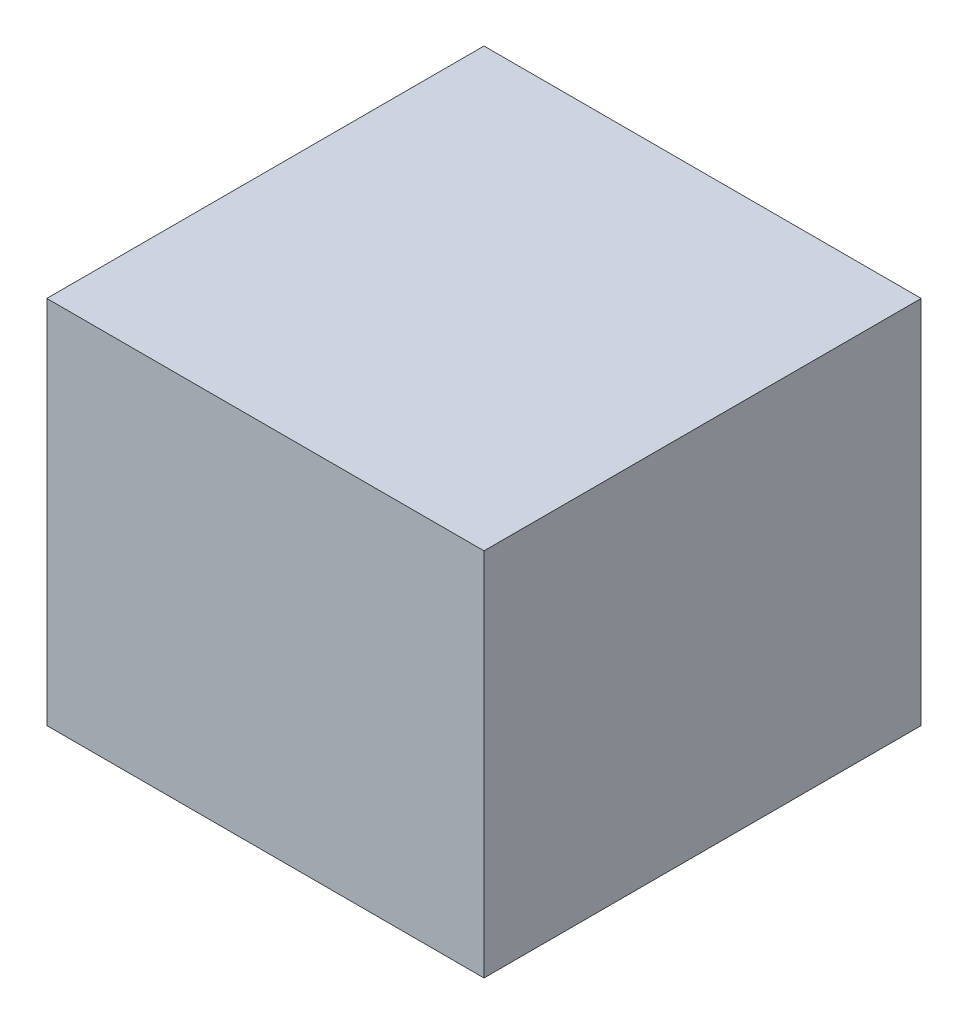
ISO-10303-21;
HEADER;
FILE_DESCRIPTION(('STEP AP214'),'2;1');
FILE_NAME('part.step','',(''),(''),'','','');
FILE_SCHEMA(('AUTOMOTIVE_DESIGN { 1 0 10303 214 1 1 1 1 }'));
ENDSEC;
DATA;
#1=APPLICATION_CONTEXT('core data for automotive mechanical design processes');
#2=APPLICATION_PROTOCOL_DEFINITION('international standard','automotive_design',2000,#1);
#3=PRODUCT_CONTEXT('',#1,'mechanical');
#4=PRODUCT('Part','Part','',(#3));
#5=PRODUCT_RELATED_PRODUCT_CATEGORY('part','',(#4));
#6=PRODUCT_DEFINITION_FORMATION('','',#4);
#7=PRODUCT_DEFINITION_CONTEXT('part definition',#1,'design');
#8=PRODUCT_DEFINITION('design','',#6,#7);
#9=PRODUCT_DEFINITION_SHAPE('','',#8);
#10=(LENGTH_UNIT() NAMED_UNIT(*) SI_UNIT(.MILLI.,.METRE.));
#11=(NAMED_UNIT(*) PLANE_ANGLE_UNIT() SI_UNIT($,.RADIAN.));
#12=(NAMED_UNIT(*) SI_UNIT($,.STERADIAN.) SOLID_ANGLE_UNIT());
#13=UNCERTAINTY_MEASURE_WITH_UNIT(LENGTH_MEASURE(1.E-05),#10,'distance_accuracy_value','');
#14=(GEOMETRIC_REPRESENTATION_CONTEXT(3) GLOBAL_UNCERTAINTY_ASSIGNED_CONTEXT((#13)) GLOBAL_UNIT_ASSIGNED_CONTEXT((#10,
#11,#12)) REPRESENTATION_CONTEXT('',''));
#15=CARTESIAN_POINT('',(0.,0.,0.));
#16=DIRECTION('',(0.,0.,1.));
#17=DIRECTION('',(1.,0.,0.));
#18=AXIS2_PLACEMENT_3D('',#15,#16,#17);
#19=CARTESIAN_POINT('',(0.,279.4,0.));
#20=DIRECTION('',(-1.,0.,0.));
#21=DIRECTION('',(0.,0.,1.));
#22=AXIS2_PLACEMENT_3D('',#19,#20,#21);
#23=PLANE('',#22);
#24=DIRECTION('',(0.,0.,-1.));
#25=VECTOR('',#24,1.);
#26=CARTESIAN_POINT('',(0.,0.,0.));
#27=LINE('',#26,#25);
#28=CARTESIAN_POINT('',(0.,0.,0.));
#29=VERTEX_POINT('',#28);
#30=CARTESIAN_POINT('',(0.,0.,-330.2));
#31=VERTEX_POINT('',#30);
#32=EDGE_CURVE('E112',#29,#31,#27,.T.);
#33=ORIENTED_EDGE('',*,*,#32,.T.);
#34=DIRECTION('',(0.,-1.,0.));
#35=VECTOR('',#34,1.);
#36=CARTESIAN_POINT('',(0.,279.4,-330.2));
#37=LINE('',#36,#35);
#38=CARTESIAN_POINT('',(0.,279.4,-330.2));
#39=VERTEX_POINT('',#38);
#40=EDGE_CURVE('E11',#39,#31,#37,.T.);
#41=ORIENTED_EDGE('',*,*,#40,.F.);
#42=DIRECTION('',(0.,0.,-1.));
#43=VECTOR('',#42,1.);
#44=CARTESIAN_POINT('',(0.,279.4,0.));
#45=LINE('',#44,#43);
#46=CARTESIAN_POINT('',(0.,279.4,0.));
#47=VERTEX_POINT('',#46);
#48=EDGE_CURVE('E96',#47,#39,#45,.T.);
#49=ORIENTED_EDGE('',*,*,#48,.F.);
#50=DIRECTION('',(0.,-1.,0.));
#51=VECTOR('',#50,1.);
#52=CARTESIAN_POINT('',(0.,279.4,0.));
#53=LINE('',#52,#51);
#54=EDGE_CURVE('E108',#47,#29,#53,.T.);
#55=ORIENTED_EDGE('',*,*,#54,.T.);
#56=EDGE_LOOP('',(#33,#41,#49,#55));
#57=FACE_BOUND('',#56,.T.);
#58=ADVANCED_FACE('F38',(#57),#23,.F.);
#59=CARTESIAN_POINT('',(0.,279.4,-330.2));
#60=DIRECTION('',(0.,0.,1.));
#61=DIRECTION('',(1.,0.,0.));
#62=AXIS2_PLACEMENT_3D('',#59,#60,#61);
#63=PLANE('',#62);
#64=DIRECTION('',(-1.,0.,0.));
#65=VECTOR('',#64,1.);
#66=CARTESIAN_POINT('',(0.,0.,-330.2));
#67=LINE('',#66,#65);
#68=CARTESIAN_POINT('',(-330.2,0.,-330.2));
#69=VERTEX_POINT('',#68);
#70=EDGE_CURVE('E101',#31,#69,#67,.T.);
#71=ORIENTED_EDGE('',*,*,#70,.T.);
#72=DIRECTION('',(0.,-1.,0.));
#73=VECTOR('',#72,1.);
#74=CARTESIAN_POINT('',(-330.2,279.4,-330.2));
#75=LINE('',#74,#73);
#76=CARTESIAN_POINT('',(-330.2,279.4,-330.2));
#77=VERTEX_POINT('',#76);
#78=EDGE_CURVE('E47',#77,#69,#75,.T.);
#79=ORIENTED_EDGE('',*,*,#78,.F.);
#80=DIRECTION('',(-1.,0.,0.));
#81=VECTOR('',#80,1.);
#82=CARTESIAN_POINT('',(0.,279.4,-330.2));
#83=LINE('',#82,#81);
#84=EDGE_CURVE('E91',#39,#77,#83,.T.);
#85=ORIENTED_EDGE('',*,*,#84,.F.);
#86=ORIENTED_EDGE('',*,*,#40,.T.);
#87=EDGE_LOOP('',(#71,#79,#85,#86));
#88=FACE_BOUND('',#87,.T.);
#89=ADVANCED_FACE('F100',(#88),#63,.F.);
#90=CARTESIAN_POINT('',(-330.2,279.4,0.));
#91=DIRECTION('',(1.,0.,0.));
#92=DIRECTION('',(0.,0.,-1.));
#93=AXIS2_PLACEMENT_3D('',#90,#91,#92);
#94=PLANE('',#93);
#95=DIRECTION('',(0.,0.,1.));
#96=VECTOR('',#95,1.);
#97=CARTESIAN_POINT('',(-330.2,0.,0.));
#98=LINE('',#97,#96);
#99=CARTESIAN_POINT('',(-330.2,0.,0.));
#100=VERTEX_POINT('',#99);
#101=EDGE_CURVE('E77',#69,#100,#98,.T.);
#102=ORIENTED_EDGE('',*,*,#101,.T.);
#103=DIRECTION('',(0.,-1.,0.));
#104=VECTOR('',#103,1.);
#105=CARTESIAN_POINT('',(-330.2,279.4,0.));
#106=LINE('',#105,#104);
#107=CARTESIAN_POINT('',(-330.2,279.4,0.));
#108=VERTEX_POINT('',#107);
#109=EDGE_CURVE('E103',#108,#100,#106,.T.);
#110=ORIENTED_EDGE('',*,*,#109,.F.);
#111=DIRECTION('',(0.,0.,1.));
#112=VECTOR('',#111,1.);
#113=CARTESIAN_POINT('',(-330.2,279.4,0.));
#114=LINE('',#113,#112);
#115=EDGE_CURVE('E94',#77,#108,#114,.T.);
#116=ORIENTED_EDGE('',*,*,#115,.F.);
#117=ORIENTED_EDGE('',*,*,#78,.T.);
#118=EDGE_LOOP('',(#102,#110,#116,#117));
#119=FACE_BOUND('',#118,.T.);
#120=ADVANCED_FACE('F104',(#119),#94,.F.);
#121=CARTESIAN_POINT('',(0.,279.4,0.));
#122=DIRECTION('',(0.,0.,-1.));
#123=DIRECTION('',(-1.,0.,0.));
#124=AXIS2_PLACEMENT_3D('',#121,#122,#123);
#125=PLANE('',#124);
#126=DIRECTION('',(1.,0.,0.));
#127=VECTOR('',#126,1.);
#128=CARTESIAN_POINT('',(0.,0.,0.));
#129=LINE('',#128,#127);
#130=EDGE_CURVE('E83',#100,#29,#129,.T.);
#131=ORIENTED_EDGE('',*,*,#130,.T.);
#132=ORIENTED_EDGE('',*,*,#54,.F.);
#133=DIRECTION('',(1.,0.,0.));
#134=VECTOR('',#133,1.);
#135=CARTESIAN_POINT('',(0.,279.4,0.));
#136=LINE('',#135,#134);
#137=EDGE_CURVE('E58',#108,#47,#136,.T.);
#138=ORIENTED_EDGE('',*,*,#137,.F.);
#139=ORIENTED_EDGE('',*,*,#109,.T.);
#140=EDGE_LOOP('',(#131,#132,#138,#139));
#141=FACE_BOUND('',#140,.T.);
#142=ADVANCED_FACE('F125',(#141),#125,.F.);
#143=CARTESIAN_POINT('',(0.,279.4,0.));
#144=DIRECTION('',(0.,1.,0.));
#145=DIRECTION('',(0.,0.,1.));
#146=AXIS2_PLACEMENT_3D('',#143,#144,#145);
#147=PLANE('',#146);
#148=ORIENTED_EDGE('',*,*,#48,.T.);
#149=ORIENTED_EDGE('',*,*,#84,.T.);
#150=ORIENTED_EDGE('',*,*,#115,.T.);
#151=ORIENTED_EDGE('',*,*,#137,.T.);
#152=EDGE_LOOP('',(#148,#149,#150,#151));
#153=FACE_BOUND('',#152,.T.);
#154=ADVANCED_FACE('F92',(#153),#147,.T.);
#155=CARTESIAN_POINT('',(0.,0.,0.));
#156=DIRECTION('',(0.,1.,0.));
#157=DIRECTION('',(0.,0.,1.));
#158=AXIS2_PLACEMENT_3D('',#155,#156,#157);
#159=PLANE('',#158);
#160=ORIENTED_EDGE('',*,*,#32,.F.);
#161=ORIENTED_EDGE('',*,*,#130,.F.);
#162=ORIENTED_EDGE('',*,*,#101,.F.);
#163=ORIENTED_EDGE('',*,*,#70,.F.);
#164=EDGE_LOOP('',(#160,#161,#162,#163));
#165=FACE_BOUND('',#164,.T.);
#166=ADVANCED_FACE('F128',(#165),#159,.F.);
#167=CLOSED_SHELL('',(#58,#89,#120,#142,#154,#166));
#168=MANIFOLD_SOLID_BREP('B2',#167);
#169=ADVANCED_BREP_SHAPE_REPRESENTATION('',(#18,#168),#14);
#170=SHAPE_DEFINITION_REPRESENTATION(#9,#169);
ENDSEC;
END-ISO-10303-21;
